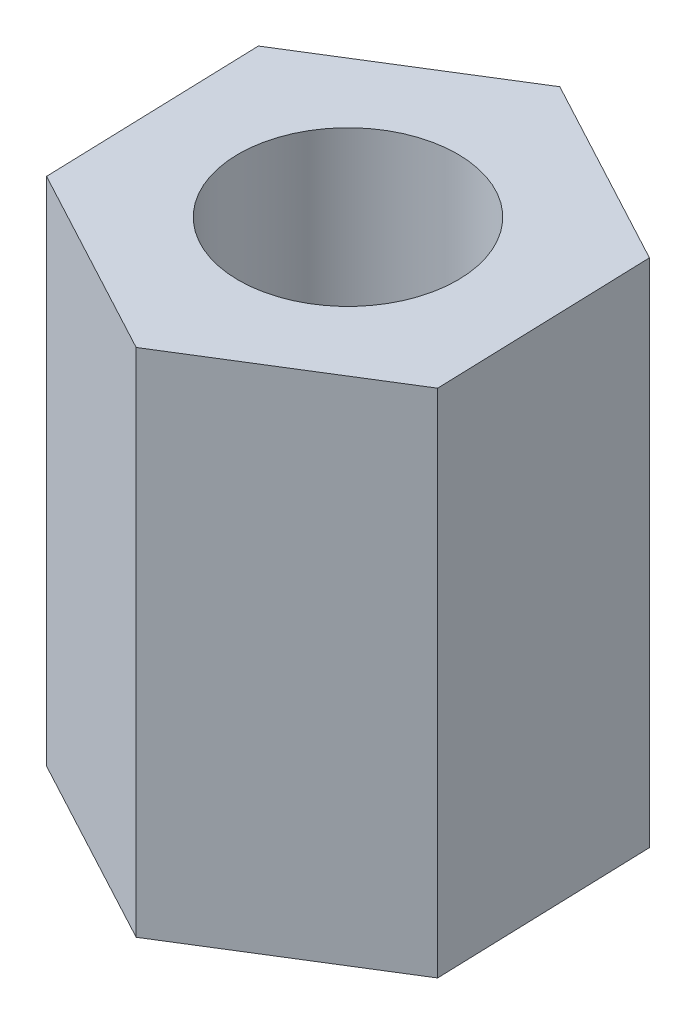
ISO-10303-21;
HEADER;
FILE_DESCRIPTION(('STEP AP214'),'2;1');
FILE_NAME('part.step','',(''),(''),'','','');
FILE_SCHEMA(('AUTOMOTIVE_DESIGN { 1 0 10303 214 1 1 1 1 }'));
ENDSEC;
DATA;
#1=APPLICATION_CONTEXT('core data for automotive mechanical design processes');
#2=APPLICATION_PROTOCOL_DEFINITION('international standard','automotive_design',2000,#1);
#3=PRODUCT_CONTEXT('',#1,'mechanical');
#4=PRODUCT('Part','Part','',(#3));
#5=PRODUCT_RELATED_PRODUCT_CATEGORY('part','',(#4));
#6=PRODUCT_DEFINITION_FORMATION('','',#4);
#7=PRODUCT_DEFINITION_CONTEXT('part definition',#1,'design');
#8=PRODUCT_DEFINITION('design','',#6,#7);
#9=PRODUCT_DEFINITION_SHAPE('','',#8);
#10=(LENGTH_UNIT() NAMED_UNIT(*) SI_UNIT(.MILLI.,.METRE.));
#11=(NAMED_UNIT(*) PLANE_ANGLE_UNIT() SI_UNIT($,.RADIAN.));
#12=(NAMED_UNIT(*) SI_UNIT($,.STERADIAN.) SOLID_ANGLE_UNIT());
#13=UNCERTAINTY_MEASURE_WITH_UNIT(LENGTH_MEASURE(1.E-05),#10,'distance_accuracy_value','');
#14=(GEOMETRIC_REPRESENTATION_CONTEXT(3) GLOBAL_UNCERTAINTY_ASSIGNED_CONTEXT((#13)) GLOBAL_UNIT_ASSIGNED_CONTEXT((#10,
#11,#12)) REPRESENTATION_CONTEXT('',''));
#15=CARTESIAN_POINT('',(0.,0.,0.));
#16=DIRECTION('',(0.,0.,1.));
#17=DIRECTION('',(1.,0.,0.));
#18=AXIS2_PLACEMENT_3D('',#15,#16,#17);
#19=CARTESIAN_POINT('',(0.,7.,0.));
#20=DIRECTION('',(0.,1.,0.));
#21=DIRECTION('',(0.,0.,1.));
#22=AXIS2_PLACEMENT_3D('',#19,#20,#21);
#23=PLANE('',#22);
#24=DIRECTION('',(-0.0319012383163269,0.,-0.999491025969661));
#25=VECTOR('',#24,1.);
#26=CARTESIAN_POINT('',(2.64460571550739,7.,1.41635469057213));
#27=LINE('',#26,#25);
#28=CARTESIAN_POINT('',(2.64460571550739,7.,1.41635469057213));
#29=VERTEX_POINT('',#28);
#30=CARTESIAN_POINT('',(2.5489020005584,7.,-1.58211838733685));
#31=VERTEX_POINT('',#30);
#32=EDGE_CURVE('E131',#29,#31,#27,.T.);
#33=ORIENTED_EDGE('',*,*,#32,.T.);
#34=DIRECTION('',(-0.881535238502462,0.,-0.47211823019071));
#35=VECTOR('',#34,1.);
#36=CARTESIAN_POINT('',(2.5489020005584,7.,-1.58211838733685));
#37=LINE('',#36,#35);
#38=CARTESIAN_POINT('',(-0.0957037149489802,7.,-2.99847307790898));
#39=VERTEX_POINT('',#38);
#40=EDGE_CURVE('E89',#31,#39,#37,.T.);
#41=ORIENTED_EDGE('',*,*,#40,.T.);
#42=DIRECTION('',(-0.849634000186134,0.,0.527372795778951));
#43=VECTOR('',#42,1.);
#44=CARTESIAN_POINT('',(-0.0957037149489802,7.,-2.99847307790898));
#45=LINE('',#44,#43);
#46=CARTESIAN_POINT('',(-2.64460571550739,7.,-1.41635469057213));
#47=VERTEX_POINT('',#46);
#48=EDGE_CURVE('E102',#39,#47,#45,.T.);
#49=ORIENTED_EDGE('',*,*,#48,.T.);
#50=DIRECTION('',(0.0319012383163269,0.,0.999491025969661));
#51=VECTOR('',#50,1.);
#52=CARTESIAN_POINT('',(-2.64460571550739,7.,-1.41635469057213));
#53=LINE('',#52,#51);
#54=CARTESIAN_POINT('',(-2.5489020005584,7.,1.58211838733685));
#55=VERTEX_POINT('',#54);
#56=EDGE_CURVE('E96',#47,#55,#53,.T.);
#57=ORIENTED_EDGE('',*,*,#56,.T.);
#58=DIRECTION('',(0.881535238502462,0.,0.47211823019071));
#59=VECTOR('',#58,1.);
#60=CARTESIAN_POINT('',(-2.5489020005584,7.,1.58211838733685));
#61=LINE('',#60,#59);
#62=CARTESIAN_POINT('',(0.0957037149489806,7.,2.99847307790898));
#63=VERTEX_POINT('',#62);
#64=EDGE_CURVE('E100',#55,#63,#61,.T.);
#65=ORIENTED_EDGE('',*,*,#64,.T.);
#66=DIRECTION('',(0.849634000186135,0.,-0.527372795778951));
#67=VECTOR('',#66,1.);
#68=CARTESIAN_POINT('',(0.0957037149489806,7.,2.99847307790898));
#69=LINE('',#68,#67);
#70=EDGE_CURVE('E52',#63,#29,#69,.T.);
#71=ORIENTED_EDGE('',*,*,#70,.T.);
#72=EDGE_LOOP('',(#33,#41,#49,#57,#65,#71));
#73=FACE_BOUND('',#72,.T.);
#74=CARTESIAN_POINT('',(0.,7.,0.));
#75=DIRECTION('',(0.,1.,0.));
#76=DIRECTION('',(0.,0.,1.));
#77=AXIS2_PLACEMENT_3D('',#74,#75,#76);
#78=CIRCLE('',#77,1.5);
#79=CARTESIAN_POINT('',(0.,7.,1.5));
#80=VERTEX_POINT('',#79);
#81=EDGE_CURVE('E124',#80,#80,#78,.T.);
#82=ORIENTED_EDGE('',*,*,#81,.F.);
#83=EDGE_LOOP('',(#82));
#84=FACE_BOUND('',#83,.T.);
#85=ADVANCED_FACE('F35',(#73,#84),#23,.T.);
#86=CARTESIAN_POINT('',(0.,0.,0.));
#87=DIRECTION('',(0.,1.,0.));
#88=DIRECTION('',(0.,0.,1.));
#89=AXIS2_PLACEMENT_3D('',#86,#87,#88);
#90=PLANE('',#89);
#91=DIRECTION('',(-0.0319012383163269,0.,-0.999491025969661));
#92=VECTOR('',#91,1.);
#93=CARTESIAN_POINT('',(2.64460571550739,0.,1.41635469057213));
#94=LINE('',#93,#92);
#95=CARTESIAN_POINT('',(2.64460571550739,0.,1.41635469057213));
#96=VERTEX_POINT('',#95);
#97=CARTESIAN_POINT('',(2.5489020005584,0.,-1.58211838733685));
#98=VERTEX_POINT('',#97);
#99=EDGE_CURVE('E120',#96,#98,#94,.T.);
#100=ORIENTED_EDGE('',*,*,#99,.F.);
#101=DIRECTION('',(0.849634000186135,0.,-0.527372795778951));
#102=VECTOR('',#101,1.);
#103=CARTESIAN_POINT('',(0.0957037149489806,0.,2.99847307790898));
#104=LINE('',#103,#102);
#105=CARTESIAN_POINT('',(0.0957037149489806,0.,2.99847307790898));
#106=VERTEX_POINT('',#105);
#107=EDGE_CURVE('E81',#106,#96,#104,.T.);
#108=ORIENTED_EDGE('',*,*,#107,.F.);
#109=DIRECTION('',(0.881535238502462,0.,0.47211823019071));
#110=VECTOR('',#109,1.);
#111=CARTESIAN_POINT('',(-2.5489020005584,0.,1.58211838733685));
#112=LINE('',#111,#110);
#113=CARTESIAN_POINT('',(-2.5489020005584,0.,1.58211838733685));
#114=VERTEX_POINT('',#113);
#115=EDGE_CURVE('E75',#114,#106,#112,.T.);
#116=ORIENTED_EDGE('',*,*,#115,.F.);
#117=DIRECTION('',(0.0319012383163269,0.,0.999491025969661));
#118=VECTOR('',#117,1.);
#119=CARTESIAN_POINT('',(-2.64460571550739,0.,-1.41635469057213));
#120=LINE('',#119,#118);
#121=CARTESIAN_POINT('',(-2.64460571550739,0.,-1.41635469057213));
#122=VERTEX_POINT('',#121);
#123=EDGE_CURVE('E110',#122,#114,#120,.T.);
#124=ORIENTED_EDGE('',*,*,#123,.F.);
#125=DIRECTION('',(-0.849634000186134,0.,0.527372795778951));
#126=VECTOR('',#125,1.);
#127=CARTESIAN_POINT('',(-0.0957037149489802,0.,-2.99847307790898));
#128=LINE('',#127,#126);
#129=CARTESIAN_POINT('',(-0.0957037149489802,0.,-2.99847307790898));
#130=VERTEX_POINT('',#129);
#131=EDGE_CURVE('E126',#130,#122,#128,.T.);
#132=ORIENTED_EDGE('',*,*,#131,.F.);
#133=DIRECTION('',(-0.881535238502462,0.,-0.47211823019071));
#134=VECTOR('',#133,1.);
#135=CARTESIAN_POINT('',(2.5489020005584,0.,-1.58211838733685));
#136=LINE('',#135,#134);
#137=EDGE_CURVE('E123',#98,#130,#136,.T.);
#138=ORIENTED_EDGE('',*,*,#137,.F.);
#139=EDGE_LOOP('',(#100,#108,#116,#124,#132,#138));
#140=FACE_BOUND('',#139,.T.);
#141=CARTESIAN_POINT('',(0.,0.,0.));
#142=DIRECTION('',(0.,1.,0.));
#143=DIRECTION('',(0.,0.,1.));
#144=AXIS2_PLACEMENT_3D('',#141,#142,#143);
#145=CIRCLE('',#144,1.5);
#146=CARTESIAN_POINT('',(0.,0.,1.5));
#147=VERTEX_POINT('',#146);
#148=EDGE_CURVE('E236',#147,#147,#145,.T.);
#149=ORIENTED_EDGE('',*,*,#148,.T.);
#150=EDGE_LOOP('',(#149));
#151=FACE_BOUND('',#150,.T.);
#152=ADVANCED_FACE('F140',(#140,#151),#90,.F.);
#153=CARTESIAN_POINT('',(2.64460571550739,7.,1.41635469057213));
#154=DIRECTION('',(-0.999491025969661,0.,0.0319012383163269));
#155=DIRECTION('',(0.0319012383163269,0.,0.999491025969661));
#156=AXIS2_PLACEMENT_3D('',#153,#154,#155);
#157=PLANE('',#156);
#158=ORIENTED_EDGE('',*,*,#99,.T.);
#159=DIRECTION('',(0.,-1.,0.));
#160=VECTOR('',#159,1.);
#161=CARTESIAN_POINT('',(2.5489020005584,7.,-1.58211838733685));
#162=LINE('',#161,#160);
#163=EDGE_CURVE('E11',#31,#98,#162,.T.);
#164=ORIENTED_EDGE('',*,*,#163,.F.);
#165=ORIENTED_EDGE('',*,*,#32,.F.);
#166=DIRECTION('',(0.,-1.,0.));
#167=VECTOR('',#166,1.);
#168=CARTESIAN_POINT('',(2.64460571550739,7.,1.41635469057213));
#169=LINE('',#168,#167);
#170=EDGE_CURVE('E116',#29,#96,#169,.T.);
#171=ORIENTED_EDGE('',*,*,#170,.T.);
#172=EDGE_LOOP('',(#158,#164,#165,#171));
#173=FACE_BOUND('',#172,.T.);
#174=ADVANCED_FACE('F37',(#173),#157,.F.);
#175=CARTESIAN_POINT('',(2.5489020005584,7.,-1.58211838733685));
#176=DIRECTION('',(-0.47211823019071,0.,0.881535238502462));
#177=DIRECTION('',(0.881535238502462,0.,0.47211823019071));
#178=AXIS2_PLACEMENT_3D('',#175,#176,#177);
#179=PLANE('',#178);
#180=ORIENTED_EDGE('',*,*,#137,.T.);
#181=DIRECTION('',(0.,-1.,0.));
#182=VECTOR('',#181,1.);
#183=CARTESIAN_POINT('',(-0.0957037149489802,7.,-2.99847307790898));
#184=LINE('',#183,#182);
#185=EDGE_CURVE('E44',#39,#130,#184,.T.);
#186=ORIENTED_EDGE('',*,*,#185,.F.);
#187=ORIENTED_EDGE('',*,*,#40,.F.);
#188=ORIENTED_EDGE('',*,*,#163,.T.);
#189=EDGE_LOOP('',(#180,#186,#187,#188));
#190=FACE_BOUND('',#189,.T.);
#191=ADVANCED_FACE('F165',(#190),#179,.F.);
#192=CARTESIAN_POINT('',(-0.0957037149489802,7.,-2.99847307790898));
#193=DIRECTION('',(0.527372795778951,0.,0.849634000186135));
#194=DIRECTION('',(0.849634000186135,0.,-0.527372795778951));
#195=AXIS2_PLACEMENT_3D('',#192,#193,#194);
#196=PLANE('',#195);
#197=ORIENTED_EDGE('',*,*,#131,.T.);
#198=DIRECTION('',(0.,-1.,0.));
#199=VECTOR('',#198,1.);
#200=CARTESIAN_POINT('',(-2.64460571550739,7.,-1.41635469057213));
#201=LINE('',#200,#199);
#202=EDGE_CURVE('E111',#47,#122,#201,.T.);
#203=ORIENTED_EDGE('',*,*,#202,.F.);
#204=ORIENTED_EDGE('',*,*,#48,.F.);
#205=ORIENTED_EDGE('',*,*,#185,.T.);
#206=EDGE_LOOP('',(#197,#203,#204,#205));
#207=FACE_BOUND('',#206,.T.);
#208=ADVANCED_FACE('F137',(#207),#196,.F.);
#209=CARTESIAN_POINT('',(-2.64460571550739,7.,-1.41635469057213));
#210=DIRECTION('',(0.999491025969661,0.,-0.0319012383163269));
#211=DIRECTION('',(-0.0319012383163269,0.,-0.999491025969661));
#212=AXIS2_PLACEMENT_3D('',#209,#210,#211);
#213=PLANE('',#212);
#214=ORIENTED_EDGE('',*,*,#123,.T.);
#215=DIRECTION('',(0.,-1.,0.));
#216=VECTOR('',#215,1.);
#217=CARTESIAN_POINT('',(-2.5489020005584,7.,1.58211838733685));
#218=LINE('',#217,#216);
#219=EDGE_CURVE('E107',#55,#114,#218,.T.);
#220=ORIENTED_EDGE('',*,*,#219,.F.);
#221=ORIENTED_EDGE('',*,*,#56,.F.);
#222=ORIENTED_EDGE('',*,*,#202,.T.);
#223=EDGE_LOOP('',(#214,#220,#221,#222));
#224=FACE_BOUND('',#223,.T.);
#225=ADVANCED_FACE('F108',(#224),#213,.F.);
#226=CARTESIAN_POINT('',(-2.5489020005584,7.,1.58211838733685));
#227=DIRECTION('',(0.47211823019071,0.,-0.881535238502462));
#228=DIRECTION('',(-0.881535238502462,0.,-0.47211823019071));
#229=AXIS2_PLACEMENT_3D('',#226,#227,#228);
#230=PLANE('',#229);
#231=ORIENTED_EDGE('',*,*,#115,.T.);
#232=DIRECTION('',(0.,-1.,0.));
#233=VECTOR('',#232,1.);
#234=CARTESIAN_POINT('',(0.0957037149489806,7.,2.99847307790898));
#235=LINE('',#234,#233);
#236=EDGE_CURVE('E112',#63,#106,#235,.T.);
#237=ORIENTED_EDGE('',*,*,#236,.F.);
#238=ORIENTED_EDGE('',*,*,#64,.F.);
#239=ORIENTED_EDGE('',*,*,#219,.T.);
#240=EDGE_LOOP('',(#231,#237,#238,#239));
#241=FACE_BOUND('',#240,.T.);
#242=ADVANCED_FACE('F114',(#241),#230,.F.);
#243=CARTESIAN_POINT('',(0.0957037149489806,7.,2.99847307790898));
#244=DIRECTION('',(-0.527372795778951,0.,-0.849634000186135));
#245=DIRECTION('',(-0.849634000186135,0.,0.527372795778951));
#246=AXIS2_PLACEMENT_3D('',#243,#244,#245);
#247=PLANE('',#246);
#248=ORIENTED_EDGE('',*,*,#107,.T.);
#249=ORIENTED_EDGE('',*,*,#170,.F.);
#250=ORIENTED_EDGE('',*,*,#70,.F.);
#251=ORIENTED_EDGE('',*,*,#236,.T.);
#252=EDGE_LOOP('',(#248,#249,#250,#251));
#253=FACE_BOUND('',#252,.T.);
#254=ADVANCED_FACE('F145',(#253),#247,.F.);
#255=CARTESIAN_POINT('',(0.,7.,0.));
#256=DIRECTION('',(0.,-1.,0.));
#257=DIRECTION('',(0.,0.,-1.));
#258=AXIS2_PLACEMENT_3D('',#255,#256,#257);
#259=CYLINDRICAL_SURFACE('',#258,1.5);
#260=ORIENTED_EDGE('',*,*,#81,.T.);
#261=EDGE_LOOP('',(#260));
#262=FACE_BOUND('',#261,.T.);
#263=ORIENTED_EDGE('',*,*,#148,.F.);
#264=EDGE_LOOP('',(#263));
#265=FACE_BOUND('',#264,.T.);
#266=ADVANCED_FACE('F147',(#262,#265),#259,.F.);
#267=CLOSED_SHELL('',(#85,#152,#174,#191,#208,#225,#242,#254,#266));
#268=MANIFOLD_SOLID_BREP('B2',#267);
#269=ADVANCED_BREP_SHAPE_REPRESENTATION('',(#18,#268),#14);
#270=SHAPE_DEFINITION_REPRESENTATION(#9,#269);
ENDSEC;
END-ISO-10303-21;
